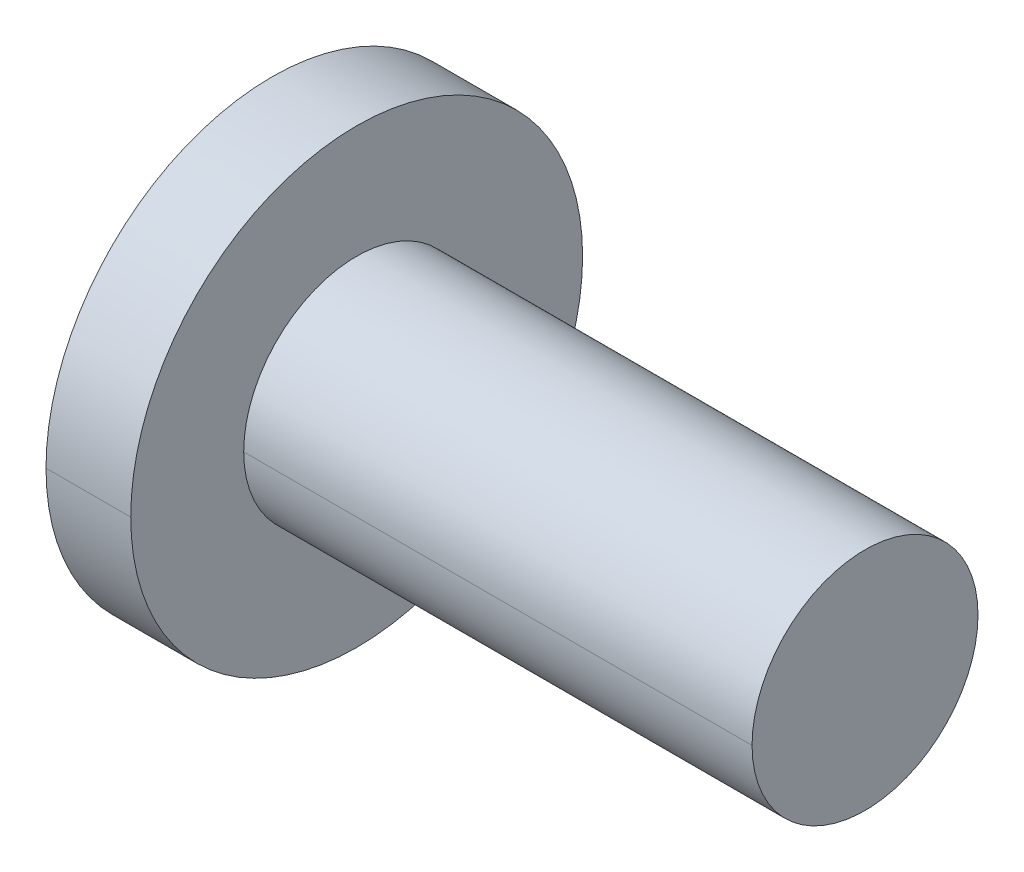
ISO-10303-21;
HEADER;
FILE_DESCRIPTION(('STEP AP214'),'2;1');
FILE_NAME('part.step','',(''),(''),'','','');
FILE_SCHEMA(('AUTOMOTIVE_DESIGN { 1 0 10303 214 1 1 1 1 }'));
ENDSEC;
DATA;
#1=APPLICATION_CONTEXT('core data for automotive mechanical design processes');
#2=APPLICATION_PROTOCOL_DEFINITION('international standard','automotive_design',2000,#1);
#3=PRODUCT_CONTEXT('',#1,'mechanical');
#4=PRODUCT('Part','Part','',(#3));
#5=PRODUCT_RELATED_PRODUCT_CATEGORY('part','',(#4));
#6=PRODUCT_DEFINITION_FORMATION('','',#4);
#7=PRODUCT_DEFINITION_CONTEXT('part definition',#1,'design');
#8=PRODUCT_DEFINITION('design','',#6,#7);
#9=PRODUCT_DEFINITION_SHAPE('','',#8);
#10=(LENGTH_UNIT() NAMED_UNIT(*) SI_UNIT(.MILLI.,.METRE.));
#11=(NAMED_UNIT(*) PLANE_ANGLE_UNIT() SI_UNIT($,.RADIAN.));
#12=(NAMED_UNIT(*) SI_UNIT($,.STERADIAN.) SOLID_ANGLE_UNIT());
#13=UNCERTAINTY_MEASURE_WITH_UNIT(LENGTH_MEASURE(1.E-05),#10,'distance_accuracy_value','');
#14=(GEOMETRIC_REPRESENTATION_CONTEXT(3) GLOBAL_UNCERTAINTY_ASSIGNED_CONTEXT((#13)) GLOBAL_UNIT_ASSIGNED_CONTEXT((#10,
#11,#12)) REPRESENTATION_CONTEXT('',''));
#15=CARTESIAN_POINT('',(0.,0.,0.));
#16=DIRECTION('',(0.,0.,1.));
#17=DIRECTION('',(1.,0.,0.));
#18=AXIS2_PLACEMENT_3D('',#15,#16,#17);
#19=CARTESIAN_POINT('',(-1.5,0.,0.));
#20=DIRECTION('',(1.,0.,0.));
#21=DIRECTION('',(0.,0.,-1.));
#22=AXIS2_PLACEMENT_3D('',#19,#20,#21);
#23=PLANE('',#22);
#24=CARTESIAN_POINT('',(-1.5,0.,0.));
#25=DIRECTION('',(1.,0.,0.));
#26=DIRECTION('',(0.,0.,-1.));
#27=AXIS2_PLACEMENT_3D('',#24,#25,#26);
#28=CIRCLE('',#27,4.);
#29=CARTESIAN_POINT('',(-1.5,0.,4.));
#30=VERTEX_POINT('',#29);
#31=CARTESIAN_POINT('',(-1.5,0.,-4.));
#32=VERTEX_POINT('',#31);
#33=EDGE_CURVE('E44',#30,#32,#28,.T.);
#34=ORIENTED_EDGE('',*,*,#33,.F.);
#35=CARTESIAN_POINT('',(-1.5,0.,0.));
#36=DIRECTION('',(1.,0.,0.));
#37=DIRECTION('',(0.,0.,-1.));
#38=AXIS2_PLACEMENT_3D('',#35,#36,#37);
#39=CIRCLE('',#38,4.);
#40=EDGE_CURVE('E318',#32,#30,#39,.T.);
#41=ORIENTED_EDGE('',*,*,#40,.F.);
#42=EDGE_LOOP('',(#34,#41));
#43=FACE_BOUND('',#42,.T.);
#44=CARTESIAN_POINT('',(-1.5,0.981495457622327,0.566666666666635));
#45=DIRECTION('',(1.,0.,0.));
#46=DIRECTION('',(0.,0.,-1.));
#47=AXIS2_PLACEMENT_3D('',#44,#45,#46);
#48=CIRCLE('',#47,0.200000000000005);
#49=CARTESIAN_POINT('',(-1.5,1.0588012008707,0.38221119219971));
#50=VERTEX_POINT('',#49);
#51=CARTESIAN_POINT('',(-1.5,0.86040520249101,0.7258431414116));
#52=VERTEX_POINT('',#51);
#53=EDGE_CURVE('E308',#50,#52,#48,.T.);
#54=ORIENTED_EDGE('',*,*,#53,.T.);
#55=CARTESIAN_POINT('',(-1.5,0.666666666666669,1.15470053837926));
#56=DIRECTION('',(1.,0.,0.));
#57=DIRECTION('',(0.,0.,-1.));
#58=AXIS2_PLACEMENT_3D('',#55,#56,#57);
#59=CIRCLE('',#58,0.470588235294121);
#60=CARTESIAN_POINT('',(-1.5,0.19839599837964,1.1080543336113));
#61=VERTEX_POINT('',#60);
#62=EDGE_CURVE('E302',#61,#52,#59,.T.);
#63=ORIENTED_EDGE('',*,*,#62,.F.);
#64=CARTESIAN_POINT('',(-1.5,0.,1.1333333333333));
#65=DIRECTION('',(1.,0.,0.));
#66=DIRECTION('',(0.,0.,-1.));
#67=AXIS2_PLACEMENT_3D('',#64,#65,#66);
#68=CIRCLE('',#67,0.2);
#69=CARTESIAN_POINT('',(-1.5,-0.19839599837964,1.1080543336113));
#70=VERTEX_POINT('',#69);
#71=EDGE_CURVE('E300',#61,#70,#68,.T.);
#72=ORIENTED_EDGE('',*,*,#71,.T.);
#73=CARTESIAN_POINT('',(-1.5,-0.666666666666669,1.15470053837926));
#74=DIRECTION('',(1.,0.,0.));
#75=DIRECTION('',(0.,0.,-1.));
#76=AXIS2_PLACEMENT_3D('',#73,#74,#75);
#77=CIRCLE('',#76,0.470588235294122);
#78=CARTESIAN_POINT('',(-1.5,-0.86040520249101,0.7258431414116));
#79=VERTEX_POINT('',#78);
#80=EDGE_CURVE('E289',#79,#70,#77,.T.);
#81=ORIENTED_EDGE('',*,*,#80,.F.);
#82=CARTESIAN_POINT('',(-1.5,-0.981495457622395,0.566666666666697));
#83=DIRECTION('',(1.,0.,0.));
#84=DIRECTION('',(0.,0.,-1.));
#85=AXIS2_PLACEMENT_3D('',#82,#83,#84);
#86=CIRCLE('',#85,0.199999999999997);
#87=CARTESIAN_POINT('',(-1.5,-1.0588012008706,0.38221119219971));
#88=VERTEX_POINT('',#87);
#89=EDGE_CURVE('E284',#79,#88,#86,.T.);
#90=ORIENTED_EDGE('',*,*,#89,.T.);
#91=CARTESIAN_POINT('',(-1.5,-1.33333333333334,0.));
#92=DIRECTION('',(1.,0.,0.));
#93=DIRECTION('',(0.,0.,-1.));
#94=AXIS2_PLACEMENT_3D('',#91,#92,#93);
#95=CIRCLE('',#94,0.470588235294124);
#96=CARTESIAN_POINT('',(-1.5,-1.0588012008707,-0.38221119219971));
#97=VERTEX_POINT('',#96);
#98=EDGE_CURVE('E281',#97,#88,#95,.T.);
#99=ORIENTED_EDGE('',*,*,#98,.F.);
#100=CARTESIAN_POINT('',(-1.5,-0.981495457622394,-0.566666666666674));
#101=DIRECTION('',(1.,0.,0.));
#102=DIRECTION('',(0.,0.,-1.));
#103=AXIS2_PLACEMENT_3D('',#100,#101,#102);
#104=CIRCLE('',#103,0.200000000000014);
#105=CARTESIAN_POINT('',(-1.5,-0.86040520249101,-0.7258431414116));
#106=VERTEX_POINT('',#105);
#107=EDGE_CURVE('E270',#97,#106,#104,.T.);
#108=ORIENTED_EDGE('',*,*,#107,.T.);
#109=CARTESIAN_POINT('',(-1.5,-0.666666666666669,-1.15470053837926));
#110=DIRECTION('',(1.,0.,0.));
#111=DIRECTION('',(0.,0.,-1.));
#112=AXIS2_PLACEMENT_3D('',#109,#110,#111);
#113=CIRCLE('',#112,0.470588235294121);
#114=CARTESIAN_POINT('',(-1.5,-0.19839599837964,-1.1080543336113));
#115=VERTEX_POINT('',#114);
#116=EDGE_CURVE('E264',#115,#106,#113,.T.);
#117=ORIENTED_EDGE('',*,*,#116,.F.);
#118=CARTESIAN_POINT('',(-1.5,0.,-1.1333333333333));
#119=DIRECTION('',(1.,0.,0.));
#120=DIRECTION('',(0.,0.,-1.));
#121=AXIS2_PLACEMENT_3D('',#118,#119,#120);
#122=CIRCLE('',#121,0.2);
#123=CARTESIAN_POINT('',(-1.5,0.19839599837964,-1.1080543336113));
#124=VERTEX_POINT('',#123);
#125=EDGE_CURVE('E262',#115,#124,#122,.T.);
#126=ORIENTED_EDGE('',*,*,#125,.T.);
#127=CARTESIAN_POINT('',(-1.5,0.666666666666664,-1.15470053837924));
#128=DIRECTION('',(1.,0.,0.));
#129=DIRECTION('',(0.,0.,-1.));
#130=AXIS2_PLACEMENT_3D('',#127,#128,#129);
#131=CIRCLE('',#130,0.470588235294114);
#132=CARTESIAN_POINT('',(-1.5,0.86040520249102,-0.7258431414116));
#133=VERTEX_POINT('',#132);
#134=EDGE_CURVE('E261',#133,#124,#131,.T.);
#135=ORIENTED_EDGE('',*,*,#134,.F.);
#136=CARTESIAN_POINT('',(-1.5,0.981495457622399,-0.566666666666696));
#137=DIRECTION('',(1.,0.,0.));
#138=DIRECTION('',(0.,0.,-1.));
#139=AXIS2_PLACEMENT_3D('',#136,#137,#138);
#140=CIRCLE('',#139,0.199999999999994);
#141=CARTESIAN_POINT('',(-1.5,1.0588012008706,-0.382211192199711));
#142=VERTEX_POINT('',#141);
#143=EDGE_CURVE('E245',#133,#142,#140,.T.);
#144=ORIENTED_EDGE('',*,*,#143,.T.);
#145=CARTESIAN_POINT('',(-1.5,1.33333333333334,0.));
#146=DIRECTION('',(-1.,0.,0.));
#147=DIRECTION('',(0.,0.,-1.));
#148=AXIS2_PLACEMENT_3D('',#145,#146,#147);
#149=CIRCLE('',#148,0.470588235294124);
#150=EDGE_CURVE('E241',#142,#50,#149,.T.);
#151=ORIENTED_EDGE('',*,*,#150,.T.);
#152=EDGE_LOOP('',(#54,#63,#72,#81,#90,#99,#108,#117,#126,#135,#144,#151));
#153=FACE_BOUND('',#152,.T.);
#154=ADVANCED_FACE('F37',(#43,#153),#23,.F.);
#155=CARTESIAN_POINT('',(0.,1.33333333333334,0.));
#156=DIRECTION('',(-1.,0.,0.));
#157=DIRECTION('',(0.,1.,-1.30500995355961E-13));
#158=AXIS2_PLACEMENT_3D('',#155,#156,#157);
#159=CYLINDRICAL_SURFACE('',#158,0.470588235294124);
#160=DIRECTION('',(-1.,0.,0.));
#161=VECTOR('',#160,1.);
#162=CARTESIAN_POINT('',(0.,1.0588012008707,0.38221119219971));
#163=LINE('',#162,#161);
#164=CARTESIAN_POINT('',(0.,1.0588012008707,0.38221119219971));
#165=VERTEX_POINT('',#164);
#166=EDGE_CURVE('E235',#165,#50,#163,.T.);
#167=ORIENTED_EDGE('',*,*,#166,.T.);
#168=ORIENTED_EDGE('',*,*,#150,.F.);
#169=DIRECTION('',(-1.,0.,0.));
#170=VECTOR('',#169,1.);
#171=CARTESIAN_POINT('',(0.,1.0588012008706,-0.382211192199711));
#172=LINE('',#171,#170);
#173=CARTESIAN_POINT('',(0.,1.0588012008706,-0.382211192199711));
#174=VERTEX_POINT('',#173);
#175=EDGE_CURVE('E231',#174,#142,#172,.T.);
#176=ORIENTED_EDGE('',*,*,#175,.F.);
#177=CARTESIAN_POINT('',(0.,1.33333333333334,0.));
#178=DIRECTION('',(1.,0.,0.));
#179=DIRECTION('',(0.,0.,-1.));
#180=AXIS2_PLACEMENT_3D('',#177,#178,#179);
#181=CIRCLE('',#180,0.470588235294124);
#182=EDGE_CURVE('E226',#165,#174,#181,.T.);
#183=ORIENTED_EDGE('',*,*,#182,.F.);
#184=EDGE_LOOP('',(#167,#168,#176,#183));
#185=FACE_BOUND('',#184,.T.);
#186=ADVANCED_FACE('F334',(#185),#159,.T.);
#187=CARTESIAN_POINT('',(0.,0.824081062144498,0.860683602522947));
#188=DIRECTION('',(1.,0.,0.));
#189=DIRECTION('',(0.,0.,-1.));
#190=AXIS2_PLACEMENT_3D('',#187,#188,#189);
#191=PLANE('',#190);
#192=CARTESIAN_POINT('',(0.,0.666666666666669,1.15470053837926));
#193=DIRECTION('',(1.,0.,0.));
#194=DIRECTION('',(0.,0.,-1.));
#195=AXIS2_PLACEMENT_3D('',#192,#193,#194);
#196=CIRCLE('',#195,0.470588235294121);
#197=CARTESIAN_POINT('',(0.,0.19839599837964,1.1080543336113));
#198=VERTEX_POINT('',#197);
#199=CARTESIAN_POINT('',(0.,0.86040520249101,0.7258431414116));
#200=VERTEX_POINT('',#199);
#201=EDGE_CURVE('E222',#198,#200,#196,.T.);
#202=ORIENTED_EDGE('',*,*,#201,.T.);
#203=CARTESIAN_POINT('',(0.,0.981495457622327,0.566666666666635));
#204=DIRECTION('',(1.,0.,0.));
#205=DIRECTION('',(0.,0.,-1.));
#206=AXIS2_PLACEMENT_3D('',#203,#204,#205);
#207=CIRCLE('',#206,0.200000000000005);
#208=EDGE_CURVE('E218',#165,#200,#207,.T.);
#209=ORIENTED_EDGE('',*,*,#208,.F.);
#210=ORIENTED_EDGE('',*,*,#182,.T.);
#211=CARTESIAN_POINT('',(0.,0.981495457622399,-0.566666666666696));
#212=DIRECTION('',(1.,0.,0.));
#213=DIRECTION('',(0.,0.,-1.));
#214=AXIS2_PLACEMENT_3D('',#211,#212,#213);
#215=CIRCLE('',#214,0.199999999999994);
#216=CARTESIAN_POINT('',(0.,0.86040520249102,-0.7258431414116));
#217=VERTEX_POINT('',#216);
#218=EDGE_CURVE('E216',#217,#174,#215,.T.);
#219=ORIENTED_EDGE('',*,*,#218,.F.);
#220=CARTESIAN_POINT('',(0.,0.666666666666664,-1.15470053837924));
#221=DIRECTION('',(1.,0.,0.));
#222=DIRECTION('',(0.,0.,-1.));
#223=AXIS2_PLACEMENT_3D('',#220,#221,#222);
#224=CIRCLE('',#223,0.470588235294114);
#225=CARTESIAN_POINT('',(0.,0.19839599837964,-1.1080543336113));
#226=VERTEX_POINT('',#225);
#227=EDGE_CURVE('E395',#217,#226,#224,.T.);
#228=ORIENTED_EDGE('',*,*,#227,.T.);
#229=CARTESIAN_POINT('',(0.,0.,-1.1333333333333));
#230=DIRECTION('',(1.,0.,0.));
#231=DIRECTION('',(0.,0.,-1.));
#232=AXIS2_PLACEMENT_3D('',#229,#230,#231);
#233=CIRCLE('',#232,0.2);
#234=CARTESIAN_POINT('',(0.,-0.19839599837964,-1.1080543336113));
#235=VERTEX_POINT('',#234);
#236=EDGE_CURVE('E390',#235,#226,#233,.T.);
#237=ORIENTED_EDGE('',*,*,#236,.F.);
#238=CARTESIAN_POINT('',(0.,-0.666666666666669,-1.15470053837926));
#239=DIRECTION('',(1.,0.,0.));
#240=DIRECTION('',(0.,0.,-1.));
#241=AXIS2_PLACEMENT_3D('',#238,#239,#240);
#242=CIRCLE('',#241,0.470588235294121);
#243=CARTESIAN_POINT('',(0.,-0.86040520249101,-0.7258431414116));
#244=VERTEX_POINT('',#243);
#245=EDGE_CURVE('E386',#235,#244,#242,.T.);
#246=ORIENTED_EDGE('',*,*,#245,.T.);
#247=CARTESIAN_POINT('',(0.,-0.981495457622394,-0.566666666666674));
#248=DIRECTION('',(1.,0.,0.));
#249=DIRECTION('',(0.,0.,-1.));
#250=AXIS2_PLACEMENT_3D('',#247,#248,#249);
#251=CIRCLE('',#250,0.200000000000014);
#252=CARTESIAN_POINT('',(0.,-1.0588012008707,-0.38221119219971));
#253=VERTEX_POINT('',#252);
#254=EDGE_CURVE('E381',#253,#244,#251,.T.);
#255=ORIENTED_EDGE('',*,*,#254,.F.);
#256=CARTESIAN_POINT('',(0.,-1.33333333333334,0.));
#257=DIRECTION('',(1.,0.,0.));
#258=DIRECTION('',(0.,0.,-1.));
#259=AXIS2_PLACEMENT_3D('',#256,#257,#258);
#260=CIRCLE('',#259,0.470588235294124);
#261=CARTESIAN_POINT('',(0.,-1.0588012008706,0.38221119219971));
#262=VERTEX_POINT('',#261);
#263=EDGE_CURVE('E377',#253,#262,#260,.T.);
#264=ORIENTED_EDGE('',*,*,#263,.T.);
#265=CARTESIAN_POINT('',(0.,-0.981495457622395,0.566666666666697));
#266=DIRECTION('',(1.,0.,0.));
#267=DIRECTION('',(0.,0.,-1.));
#268=AXIS2_PLACEMENT_3D('',#265,#266,#267);
#269=CIRCLE('',#268,0.199999999999997);
#270=CARTESIAN_POINT('',(0.,-0.86040520249101,0.7258431414116));
#271=VERTEX_POINT('',#270);
#272=EDGE_CURVE('E372',#271,#262,#269,.T.);
#273=ORIENTED_EDGE('',*,*,#272,.F.);
#274=CARTESIAN_POINT('',(0.,-0.666666666666669,1.15470053837926));
#275=DIRECTION('',(1.,0.,0.));
#276=DIRECTION('',(0.,0.,-1.));
#277=AXIS2_PLACEMENT_3D('',#274,#275,#276);
#278=CIRCLE('',#277,0.470588235294122);
#279=CARTESIAN_POINT('',(0.,-0.19839599837964,1.1080543336113));
#280=VERTEX_POINT('',#279);
#281=EDGE_CURVE('E354',#271,#280,#278,.T.);
#282=ORIENTED_EDGE('',*,*,#281,.T.);
#283=CARTESIAN_POINT('',(0.,0.,1.1333333333333));
#284=DIRECTION('',(1.,0.,0.));
#285=DIRECTION('',(0.,0.,-1.));
#286=AXIS2_PLACEMENT_3D('',#283,#284,#285);
#287=CIRCLE('',#286,0.2);
#288=EDGE_CURVE('E352',#198,#280,#287,.T.);
#289=ORIENTED_EDGE('',*,*,#288,.F.);
#290=EDGE_LOOP('',(#202,#209,#210,#219,#228,#237,#246,#255,#264,#273,#282,#289));
#291=FACE_BOUND('',#290,.T.);
#292=ADVANCED_FACE('F350',(#291),#191,.F.);
#293=CARTESIAN_POINT('',(0.,0.,1.1333333333333));
#294=DIRECTION('',(-1.,0.,0.));
#295=DIRECTION('',(0.,0.,-1.));
#296=AXIS2_PLACEMENT_3D('',#293,#294,#295);
#297=CYLINDRICAL_SURFACE('',#296,0.2);
#298=ORIENTED_EDGE('',*,*,#71,.F.);
#299=DIRECTION('',(-1.,0.,0.));
#300=VECTOR('',#299,1.);
#301=CARTESIAN_POINT('',(0.,0.19839599837964,1.1080543336113));
#302=LINE('',#301,#300);
#303=EDGE_CURVE('E345',#198,#61,#302,.T.);
#304=ORIENTED_EDGE('',*,*,#303,.F.);
#305=ORIENTED_EDGE('',*,*,#288,.T.);
#306=DIRECTION('',(-1.,0.,0.));
#307=VECTOR('',#306,1.);
#308=CARTESIAN_POINT('',(0.,-0.19839599837964,1.1080543336113));
#309=LINE('',#308,#307);
#310=EDGE_CURVE('E360',#280,#70,#309,.T.);
#311=ORIENTED_EDGE('',*,*,#310,.T.);
#312=EDGE_LOOP('',(#298,#304,#305,#311));
#313=FACE_BOUND('',#312,.T.);
#314=ADVANCED_FACE('F359',(#313),#297,.F.);
#315=CARTESIAN_POINT('',(0.,-0.666666666666669,1.15470053837926));
#316=DIRECTION('',(-1.,0.,0.));
#317=DIRECTION('',(0.,-0.500000002019299,0.866025402618596));
#318=AXIS2_PLACEMENT_3D('',#315,#316,#317);
#319=CYLINDRICAL_SURFACE('',#318,0.470588235294122);
#320=ORIENTED_EDGE('',*,*,#80,.T.);
#321=ORIENTED_EDGE('',*,*,#310,.F.);
#322=ORIENTED_EDGE('',*,*,#281,.F.);
#323=DIRECTION('',(-1.,0.,0.));
#324=VECTOR('',#323,1.);
#325=CARTESIAN_POINT('',(0.,-0.86040520249101,0.7258431414116));
#326=LINE('',#325,#324);
#327=EDGE_CURVE('E362',#271,#79,#326,.T.);
#328=ORIENTED_EDGE('',*,*,#327,.T.);
#329=EDGE_LOOP('',(#320,#321,#322,#328));
#330=FACE_BOUND('',#329,.T.);
#331=ADVANCED_FACE('F444',(#330),#319,.T.);
#332=CARTESIAN_POINT('',(0.,-0.981495457622395,0.566666666666697));
#333=DIRECTION('',(-1.,0.,0.));
#334=DIRECTION('',(0.,0.866025406325275,-0.499999995599143));
#335=AXIS2_PLACEMENT_3D('',#332,#333,#334);
#336=CYLINDRICAL_SURFACE('',#335,0.199999999999997);
#337=ORIENTED_EDGE('',*,*,#89,.F.);
#338=ORIENTED_EDGE('',*,*,#327,.F.);
#339=ORIENTED_EDGE('',*,*,#272,.T.);
#340=DIRECTION('',(-1.,0.,0.));
#341=VECTOR('',#340,1.);
#342=CARTESIAN_POINT('',(0.,-1.0588012008706,0.38221119219971));
#343=LINE('',#342,#341);
#344=EDGE_CURVE('E430',#262,#88,#343,.T.);
#345=ORIENTED_EDGE('',*,*,#344,.T.);
#346=EDGE_LOOP('',(#337,#338,#339,#345));
#347=FACE_BOUND('',#346,.T.);
#348=ADVANCED_FACE('F446',(#347),#336,.F.);
#349=CARTESIAN_POINT('',(0.,-1.33333333333334,0.));
#350=DIRECTION('',(-1.,0.,0.));
#351=DIRECTION('',(0.,-1.,1.30845504640801E-13));
#352=AXIS2_PLACEMENT_3D('',#349,#350,#351);
#353=CYLINDRICAL_SURFACE('',#352,0.470588235294124);
#354=ORIENTED_EDGE('',*,*,#98,.T.);
#355=ORIENTED_EDGE('',*,*,#344,.F.);
#356=ORIENTED_EDGE('',*,*,#263,.F.);
#357=DIRECTION('',(-1.,0.,0.));
#358=VECTOR('',#357,1.);
#359=CARTESIAN_POINT('',(0.,-1.0588012008707,-0.38221119219971));
#360=LINE('',#359,#358);
#361=EDGE_CURVE('E420',#253,#97,#360,.T.);
#362=ORIENTED_EDGE('',*,*,#361,.T.);
#363=EDGE_LOOP('',(#354,#355,#356,#362));
#364=FACE_BOUND('',#363,.T.);
#365=ADVANCED_FACE('F449',(#364),#353,.T.);
#366=CARTESIAN_POINT('',(0.,-0.981495457622394,-0.566666666666674));
#367=DIRECTION('',(-1.,0.,0.));
#368=DIRECTION('',(0.,0.866025406325166,0.499999995599331));
#369=AXIS2_PLACEMENT_3D('',#366,#367,#368);
#370=CYLINDRICAL_SURFACE('',#369,0.200000000000014);
#371=ORIENTED_EDGE('',*,*,#107,.F.);
#372=ORIENTED_EDGE('',*,*,#361,.F.);
#373=ORIENTED_EDGE('',*,*,#254,.T.);
#374=DIRECTION('',(-1.,0.,0.));
#375=VECTOR('',#374,1.);
#376=CARTESIAN_POINT('',(0.,-0.86040520249101,-0.7258431414116));
#377=LINE('',#376,#375);
#378=EDGE_CURVE('E414',#244,#106,#377,.T.);
#379=ORIENTED_EDGE('',*,*,#378,.T.);
#380=EDGE_LOOP('',(#371,#372,#373,#379));
#381=FACE_BOUND('',#380,.T.);
#382=ADVANCED_FACE('F454',(#381),#370,.F.);
#383=CARTESIAN_POINT('',(0.,-0.666666666666669,-1.15470053837926));
#384=DIRECTION('',(-1.,0.,0.));
#385=DIRECTION('',(0.,-0.500000002019298,-0.866025402618596));
#386=AXIS2_PLACEMENT_3D('',#383,#384,#385);
#387=CYLINDRICAL_SURFACE('',#386,0.470588235294121);
#388=ORIENTED_EDGE('',*,*,#116,.T.);
#389=ORIENTED_EDGE('',*,*,#378,.F.);
#390=ORIENTED_EDGE('',*,*,#245,.F.);
#391=DIRECTION('',(-1.,0.,0.));
#392=VECTOR('',#391,1.);
#393=CARTESIAN_POINT('',(0.,-0.19839599837964,-1.1080543336113));
#394=LINE('',#393,#392);
#395=EDGE_CURVE('E412',#235,#115,#394,.T.);
#396=ORIENTED_EDGE('',*,*,#395,.T.);
#397=EDGE_LOOP('',(#388,#389,#390,#396));
#398=FACE_BOUND('',#397,.T.);
#399=ADVANCED_FACE('F456',(#398),#387,.T.);
#400=CARTESIAN_POINT('',(0.,0.,-1.1333333333333));
#401=DIRECTION('',(-1.,0.,0.));
#402=DIRECTION('',(0.,0.,1.));
#403=AXIS2_PLACEMENT_3D('',#400,#401,#402);
#404=CYLINDRICAL_SURFACE('',#403,0.2);
#405=ORIENTED_EDGE('',*,*,#125,.F.);
#406=ORIENTED_EDGE('',*,*,#395,.F.);
#407=ORIENTED_EDGE('',*,*,#236,.T.);
#408=DIRECTION('',(-1.,0.,0.));
#409=VECTOR('',#408,1.);
#410=CARTESIAN_POINT('',(0.,0.19839599837964,-1.1080543336113));
#411=LINE('',#410,#409);
#412=EDGE_CURVE('E200',#226,#124,#411,.T.);
#413=ORIENTED_EDGE('',*,*,#412,.T.);
#414=EDGE_LOOP('',(#405,#406,#407,#413));
#415=FACE_BOUND('',#414,.T.);
#416=ADVANCED_FACE('F457',(#415),#404,.F.);
#417=CARTESIAN_POINT('',(0.,0.666666666666664,-1.15470053837924));
#418=DIRECTION('',(-1.,0.,0.));
#419=DIRECTION('',(0.,0.500000002019295,-0.866025402618598));
#420=AXIS2_PLACEMENT_3D('',#417,#418,#419);
#421=CYLINDRICAL_SURFACE('',#420,0.470588235294114);
#422=ORIENTED_EDGE('',*,*,#134,.T.);
#423=ORIENTED_EDGE('',*,*,#412,.F.);
#424=ORIENTED_EDGE('',*,*,#227,.F.);
#425=DIRECTION('',(-1.,0.,0.));
#426=VECTOR('',#425,1.);
#427=CARTESIAN_POINT('',(0.,0.86040520249102,-0.7258431414116));
#428=LINE('',#427,#426);
#429=EDGE_CURVE('E195',#217,#133,#428,.T.);
#430=ORIENTED_EDGE('',*,*,#429,.T.);
#431=EDGE_LOOP('',(#422,#423,#424,#430));
#432=FACE_BOUND('',#431,.T.);
#433=ADVANCED_FACE('F408',(#432),#421,.T.);
#434=CARTESIAN_POINT('',(0.,0.981495457622399,-0.566666666666696));
#435=DIRECTION('',(-1.,0.,0.));
#436=DIRECTION('',(0.,-0.866025406325286,0.499999995599123));
#437=AXIS2_PLACEMENT_3D('',#434,#435,#436);
#438=CYLINDRICAL_SURFACE('',#437,0.199999999999994);
#439=ORIENTED_EDGE('',*,*,#143,.F.);
#440=ORIENTED_EDGE('',*,*,#429,.F.);
#441=ORIENTED_EDGE('',*,*,#218,.T.);
#442=ORIENTED_EDGE('',*,*,#175,.T.);
#443=EDGE_LOOP('',(#439,#440,#441,#442));
#444=FACE_BOUND('',#443,.T.);
#445=ADVANCED_FACE('F404',(#444),#438,.F.);
#446=CARTESIAN_POINT('',(0.,0.666666666666669,1.15470053837926));
#447=DIRECTION('',(-1.,0.,0.));
#448=DIRECTION('',(0.,0.500000002019299,0.866025402618596));
#449=AXIS2_PLACEMENT_3D('',#446,#447,#448);
#450=CYLINDRICAL_SURFACE('',#449,0.470588235294121);
#451=ORIENTED_EDGE('',*,*,#62,.T.);
#452=DIRECTION('',(-1.,0.,0.));
#453=VECTOR('',#452,1.);
#454=CARTESIAN_POINT('',(0.,0.86040520249101,0.7258431414116));
#455=LINE('',#454,#453);
#456=EDGE_CURVE('E190',#200,#52,#455,.T.);
#457=ORIENTED_EDGE('',*,*,#456,.F.);
#458=ORIENTED_EDGE('',*,*,#201,.F.);
#459=ORIENTED_EDGE('',*,*,#303,.T.);
#460=EDGE_LOOP('',(#451,#457,#458,#459));
#461=FACE_BOUND('',#460,.T.);
#462=ADVANCED_FACE('F342',(#461),#450,.T.);
#463=CARTESIAN_POINT('',(0.,0.981495457622327,0.566666666666635));
#464=DIRECTION('',(-1.,0.,0.));
#465=DIRECTION('',(0.,-0.866025406325166,-0.499999995599331));
#466=AXIS2_PLACEMENT_3D('',#463,#464,#465);
#467=CYLINDRICAL_SURFACE('',#466,0.200000000000005);
#468=ORIENTED_EDGE('',*,*,#53,.F.);
#469=ORIENTED_EDGE('',*,*,#166,.F.);
#470=ORIENTED_EDGE('',*,*,#208,.T.);
#471=ORIENTED_EDGE('',*,*,#456,.T.);
#472=EDGE_LOOP('',(#468,#469,#470,#471));
#473=FACE_BOUND('',#472,.T.);
#474=ADVANCED_FACE('F347',(#473),#467,.F.);
#475=CARTESIAN_POINT('',(12.,0.,0.));
#476=DIRECTION('',(1.,0.,0.));
#477=DIRECTION('',(0.,-1.,0.));
#478=AXIS2_PLACEMENT_3D('',#475,#476,#477);
#479=CYLINDRICAL_SURFACE('',#478,4.);
#480=DIRECTION('',(1.,0.,0.));
#481=VECTOR('',#480,1.);
#482=CARTESIAN_POINT('',(-1.5,0.,4.));
#483=LINE('',#482,#481);
#484=CARTESIAN_POINT('',(0.,0.,4.));
#485=VERTEX_POINT('',#484);
#486=EDGE_CURVE('E186',#30,#485,#483,.T.);
#487=ORIENTED_EDGE('',*,*,#486,.T.);
#488=CARTESIAN_POINT('',(0.,0.,0.));
#489=DIRECTION('',(1.,0.,0.));
#490=DIRECTION('',(0.,0.,-1.));
#491=AXIS2_PLACEMENT_3D('',#488,#489,#490);
#492=CIRCLE('',#491,4.);
#493=CARTESIAN_POINT('',(0.,0.,-4.));
#494=VERTEX_POINT('',#493);
#495=EDGE_CURVE('E181',#494,#485,#492,.T.);
#496=ORIENTED_EDGE('',*,*,#495,.F.);
#497=DIRECTION('',(1.,0.,0.));
#498=VECTOR('',#497,1.);
#499=CARTESIAN_POINT('',(-1.5,0.,-4.));
#500=LINE('',#499,#498);
#501=EDGE_CURVE('E176',#32,#494,#500,.T.);
#502=ORIENTED_EDGE('',*,*,#501,.F.);
#503=ORIENTED_EDGE('',*,*,#40,.T.);
#504=EDGE_LOOP('',(#487,#496,#502,#503));
#505=FACE_BOUND('',#504,.T.);
#506=ADVANCED_FACE('F331',(#505),#479,.T.);
#507=CARTESIAN_POINT('',(12.,0.,0.));
#508=DIRECTION('',(1.,0.,0.));
#509=DIRECTION('',(0.,1.,0.));
#510=AXIS2_PLACEMENT_3D('',#507,#508,#509);
#511=CYLINDRICAL_SURFACE('',#510,4.);
#512=ORIENTED_EDGE('',*,*,#486,.F.);
#513=ORIENTED_EDGE('',*,*,#33,.T.);
#514=ORIENTED_EDGE('',*,*,#501,.T.);
#515=CARTESIAN_POINT('',(0.,0.,0.));
#516=DIRECTION('',(1.,0.,0.));
#517=DIRECTION('',(0.,0.,-1.));
#518=AXIS2_PLACEMENT_3D('',#515,#516,#517);
#519=CIRCLE('',#518,4.);
#520=EDGE_CURVE('E171',#485,#494,#519,.T.);
#521=ORIENTED_EDGE('',*,*,#520,.F.);
#522=EDGE_LOOP('',(#512,#513,#514,#521));
#523=FACE_BOUND('',#522,.T.);
#524=ADVANCED_FACE('F327',(#523),#511,.T.);
#525=CARTESIAN_POINT('',(0.,4.,0.));
#526=DIRECTION('',(-1.,0.,0.));
#527=DIRECTION('',(0.,0.,1.));
#528=AXIS2_PLACEMENT_3D('',#525,#526,#527);
#529=PLANE('',#528);
#530=CARTESIAN_POINT('',(0.,0.,0.));
#531=DIRECTION('',(1.,0.,0.));
#532=DIRECTION('',(0.,0.,-1.));
#533=AXIS2_PLACEMENT_3D('',#530,#531,#532);
#534=CIRCLE('',#533,2.);
#535=CARTESIAN_POINT('',(0.,0.,2.));
#536=VERTEX_POINT('',#535);
#537=CARTESIAN_POINT('',(0.,0.,-2.));
#538=VERTEX_POINT('',#537);
#539=EDGE_CURVE('E158',#536,#538,#534,.T.);
#540=ORIENTED_EDGE('',*,*,#539,.F.);
#541=CARTESIAN_POINT('',(0.,0.,0.));
#542=DIRECTION('',(1.,0.,0.));
#543=DIRECTION('',(0.,0.,-1.));
#544=AXIS2_PLACEMENT_3D('',#541,#542,#543);
#545=CIRCLE('',#544,2.);
#546=EDGE_CURVE('E160',#538,#536,#545,.T.);
#547=ORIENTED_EDGE('',*,*,#546,.F.);
#548=EDGE_LOOP('',(#540,#547));
#549=FACE_BOUND('',#548,.T.);
#550=ORIENTED_EDGE('',*,*,#495,.T.);
#551=ORIENTED_EDGE('',*,*,#520,.T.);
#552=EDGE_LOOP('',(#550,#551));
#553=FACE_BOUND('',#552,.T.);
#554=ADVANCED_FACE('F491',(#549,#553),#529,.F.);
#555=CARTESIAN_POINT('',(12.,0.,0.));
#556=DIRECTION('',(1.,0.,0.));
#557=DIRECTION('',(0.,-1.,0.));
#558=AXIS2_PLACEMENT_3D('',#555,#556,#557);
#559=CYLINDRICAL_SURFACE('',#558,2.);
#560=CARTESIAN_POINT('',(9.,0.,0.));
#561=DIRECTION('',(-1.,0.,0.));
#562=DIRECTION('',(0.,0.,1.));
#563=AXIS2_PLACEMENT_3D('',#560,#561,#562);
#564=CIRCLE('',#563,2.);
#565=CARTESIAN_POINT('',(9.,0.,-2.));
#566=VERTEX_POINT('',#565);
#567=CARTESIAN_POINT('',(9.,0.,2.));
#568=VERTEX_POINT('',#567);
#569=EDGE_CURVE('E49',#566,#568,#564,.F.);
#570=ORIENTED_EDGE('',*,*,#569,.F.);
#571=DIRECTION('',(1.,0.,0.));
#572=VECTOR('',#571,1.);
#573=CARTESIAN_POINT('',(0.,0.,-2.));
#574=LINE('',#573,#572);
#575=EDGE_CURVE('E153',#538,#566,#574,.T.);
#576=ORIENTED_EDGE('',*,*,#575,.F.);
#577=ORIENTED_EDGE('',*,*,#546,.T.);
#578=DIRECTION('',(1.,0.,0.));
#579=VECTOR('',#578,1.);
#580=CARTESIAN_POINT('',(0.,0.,2.));
#581=LINE('',#580,#579);
#582=EDGE_CURVE('E155',#536,#568,#581,.T.);
#583=ORIENTED_EDGE('',*,*,#582,.T.);
#584=EDGE_LOOP('',(#570,#576,#577,#583));
#585=FACE_BOUND('',#584,.T.);
#586=ADVANCED_FACE('F151',(#585),#559,.T.);
#587=CARTESIAN_POINT('',(12.,0.,0.));
#588=DIRECTION('',(1.,0.,0.));
#589=DIRECTION('',(0.,1.,0.));
#590=AXIS2_PLACEMENT_3D('',#587,#588,#589);
#591=CYLINDRICAL_SURFACE('',#590,2.);
#592=CARTESIAN_POINT('',(9.,0.,0.));
#593=DIRECTION('',(-1.,0.,0.));
#594=DIRECTION('',(0.,0.,1.));
#595=AXIS2_PLACEMENT_3D('',#592,#593,#594);
#596=CIRCLE('',#595,2.);
#597=EDGE_CURVE('E12',#568,#566,#596,.F.);
#598=ORIENTED_EDGE('',*,*,#597,.F.);
#599=ORIENTED_EDGE('',*,*,#582,.F.);
#600=ORIENTED_EDGE('',*,*,#539,.T.);
#601=ORIENTED_EDGE('',*,*,#575,.T.);
#602=EDGE_LOOP('',(#598,#599,#600,#601));
#603=FACE_BOUND('',#602,.T.);
#604=ADVANCED_FACE('F157',(#603),#591,.T.);
#605=CARTESIAN_POINT('',(9.,-4.000025,-3.56681628461183));
#606=DIRECTION('',(-1.,0.,0.));
#607=DIRECTION('',(0.,0.,1.));
#608=AXIS2_PLACEMENT_3D('',#605,#606,#607);
#609=PLANE('',#608);
#610=ORIENTED_EDGE('',*,*,#569,.T.);
#611=ORIENTED_EDGE('',*,*,#597,.T.);
#612=EDGE_LOOP('',(#610,#611));
#613=FACE_BOUND('',#612,.T.);
#614=ADVANCED_FACE('F144',(#613),#609,.F.);
#615=CLOSED_SHELL('',(#154,#186,#292,#314,#331,#348,#365,#382,#399,#416,#433,#445,#462,#474,
#506,#524,#554,#586,#604,#614));
#616=MANIFOLD_SOLID_BREP('B2',#615);
#617=ADVANCED_BREP_SHAPE_REPRESENTATION('',(#18,#616),#14);
#618=SHAPE_DEFINITION_REPRESENTATION(#9,#617);
ENDSEC;
END-ISO-10303-21;
